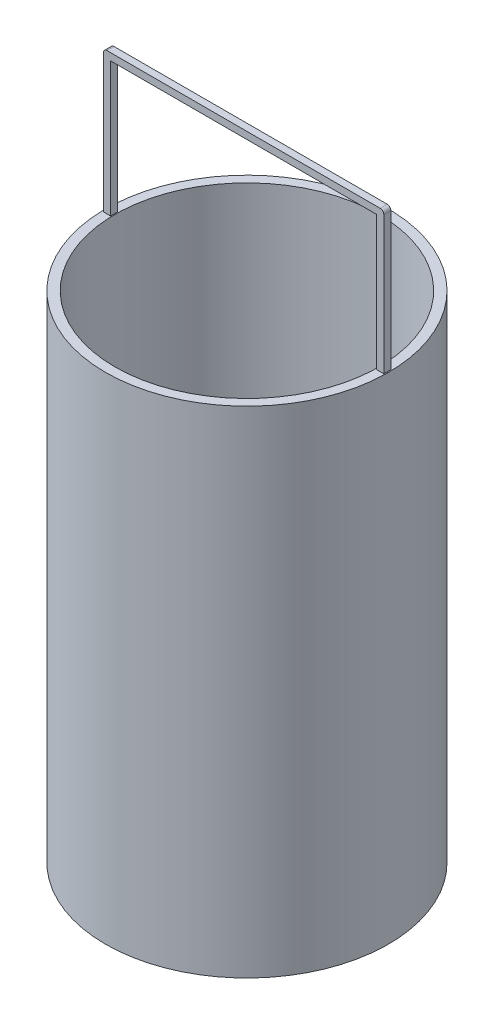
ISO-10303-21;
HEADER;
FILE_DESCRIPTION(('STEP AP214'),'2;1');
FILE_NAME('part.step','',(''),(''),'','','');
FILE_SCHEMA(('AUTOMOTIVE_DESIGN { 1 0 10303 214 1 1 1 1 }'));
ENDSEC;
DATA;
#1=APPLICATION_CONTEXT('core data for automotive mechanical design processes');
#2=APPLICATION_PROTOCOL_DEFINITION('international standard','automotive_design',2000,#1);
#3=PRODUCT_CONTEXT('',#1,'mechanical');
#4=PRODUCT('Part','Part','',(#3));
#5=PRODUCT_RELATED_PRODUCT_CATEGORY('part','',(#4));
#6=PRODUCT_DEFINITION_FORMATION('','',#4);
#7=PRODUCT_DEFINITION_CONTEXT('part definition',#1,'design');
#8=PRODUCT_DEFINITION('design','',#6,#7);
#9=PRODUCT_DEFINITION_SHAPE('','',#8);
#10=(LENGTH_UNIT() NAMED_UNIT(*) SI_UNIT(.MILLI.,.METRE.));
#11=(NAMED_UNIT(*) PLANE_ANGLE_UNIT() SI_UNIT($,.RADIAN.));
#12=(NAMED_UNIT(*) SI_UNIT($,.STERADIAN.) SOLID_ANGLE_UNIT());
#13=UNCERTAINTY_MEASURE_WITH_UNIT(LENGTH_MEASURE(1.E-05),#10,'distance_accuracy_value','');
#14=(GEOMETRIC_REPRESENTATION_CONTEXT(3) GLOBAL_UNCERTAINTY_ASSIGNED_CONTEXT((#13)) GLOBAL_UNIT_ASSIGNED_CONTEXT((#10,
#11,#12)) REPRESENTATION_CONTEXT('',''));
#15=CARTESIAN_POINT('',(0.,0.,0.));
#16=DIRECTION('',(0.,0.,1.));
#17=DIRECTION('',(1.,0.,0.));
#18=AXIS2_PLACEMENT_3D('',#15,#16,#17);
#19=CARTESIAN_POINT('',(0.,200.,0.));
#20=DIRECTION('',(0.,1.,0.));
#21=DIRECTION('',(0.,0.,1.));
#22=AXIS2_PLACEMENT_3D('',#19,#20,#21);
#23=PLANE('',#22);
#24=CARTESIAN_POINT('',(0.,200.,0.));
#25=DIRECTION('',(0.,1.,0.));
#26=DIRECTION('',(0.,0.,1.));
#27=AXIS2_PLACEMENT_3D('',#24,#25,#26);
#28=CIRCLE('',#27,112.);
#29=CARTESIAN_POINT('',(0.,200.,112.));
#30=VERTEX_POINT('',#29);
#31=EDGE_CURVE('E189',#30,#30,#28,.T.);
#32=ORIENTED_EDGE('',*,*,#31,.F.);
#33=EDGE_LOOP('',(#32));
#34=FACE_BOUND('',#33,.T.);
#35=CARTESIAN_POINT('',(0.,200.,0.));
#36=DIRECTION('',(0.,1.,0.));
#37=DIRECTION('',(0.,0.,1.));
#38=AXIS2_PLACEMENT_3D('',#35,#36,#37);
#39=CIRCLE('',#38,120.);
#40=CARTESIAN_POINT('',(0.,200.,120.));
#41=VERTEX_POINT('',#40);
#42=EDGE_CURVE('E202',#41,#41,#39,.T.);
#43=ORIENTED_EDGE('',*,*,#42,.T.);
#44=EDGE_LOOP('',(#43));
#45=FACE_BOUND('',#44,.T.);
#46=DIRECTION('',(0.,0.,1.));
#47=VECTOR('',#46,1.);
#48=CARTESIAN_POINT('',(113.045365563054,200.,-3.));
#49=LINE('',#48,#47);
#50=CARTESIAN_POINT('',(113.045365563054,200.,-3.));
#51=VERTEX_POINT('',#50);
#52=CARTESIAN_POINT('',(113.045365563054,200.,3.));
#53=VERTEX_POINT('',#52);
#54=EDGE_CURVE('E190',#51,#53,#49,.T.);
#55=ORIENTED_EDGE('',*,*,#54,.F.);
#56=DIRECTION('',(-1.,0.,0.));
#57=VECTOR('',#56,1.);
#58=CARTESIAN_POINT('',(0.,200.,-3.));
#59=LINE('',#58,#57);
#60=CARTESIAN_POINT('',(119.045365563054,200.,-3.));
#61=VERTEX_POINT('',#60);
#62=EDGE_CURVE('E179',#61,#51,#59,.T.);
#63=ORIENTED_EDGE('',*,*,#62,.F.);
#64=DIRECTION('',(0.,0.,1.));
#65=VECTOR('',#64,1.);
#66=CARTESIAN_POINT('',(119.045365563054,200.,-3.));
#67=LINE('',#66,#65);
#68=CARTESIAN_POINT('',(119.045365563054,200.,3.));
#69=VERTEX_POINT('',#68);
#70=EDGE_CURVE('E186',#61,#69,#67,.T.);
#71=ORIENTED_EDGE('',*,*,#70,.T.);
#72=DIRECTION('',(-1.,0.,0.));
#73=VECTOR('',#72,1.);
#74=CARTESIAN_POINT('',(0.,200.,3.));
#75=LINE('',#74,#73);
#76=EDGE_CURVE('E161',#69,#53,#75,.T.);
#77=ORIENTED_EDGE('',*,*,#76,.T.);
#78=EDGE_LOOP('',(#55,#63,#71,#77));
#79=FACE_BOUND('',#78,.T.);
#80=DIRECTION('',(0.,0.,1.));
#81=VECTOR('',#80,1.);
#82=CARTESIAN_POINT('',(-118.712281771735,200.,-3.));
#83=LINE('',#82,#81);
#84=CARTESIAN_POINT('',(-118.712281771735,200.,-3.));
#85=VERTEX_POINT('',#84);
#86=CARTESIAN_POINT('',(-118.712281771735,200.,3.));
#87=VERTEX_POINT('',#86);
#88=EDGE_CURVE('E140',#85,#87,#83,.T.);
#89=ORIENTED_EDGE('',*,*,#88,.F.);
#90=DIRECTION('',(1.,0.,0.));
#91=VECTOR('',#90,1.);
#92=CARTESIAN_POINT('',(0.,200.,-3.));
#93=LINE('',#92,#91);
#94=CARTESIAN_POINT('',(-112.712281771735,200.,-3.));
#95=VERTEX_POINT('',#94);
#96=EDGE_CURVE('E134',#85,#95,#93,.T.);
#97=ORIENTED_EDGE('',*,*,#96,.T.);
#98=DIRECTION('',(0.,0.,1.));
#99=VECTOR('',#98,1.);
#100=CARTESIAN_POINT('',(-112.712281771735,200.,-3.));
#101=LINE('',#100,#99);
#102=CARTESIAN_POINT('',(-112.712281771735,200.,3.));
#103=VERTEX_POINT('',#102);
#104=EDGE_CURVE('E129',#95,#103,#101,.T.);
#105=ORIENTED_EDGE('',*,*,#104,.T.);
#106=DIRECTION('',(1.,0.,0.));
#107=VECTOR('',#106,1.);
#108=CARTESIAN_POINT('',(0.,200.,3.));
#109=LINE('',#108,#107);
#110=EDGE_CURVE('E131',#87,#103,#109,.T.);
#111=ORIENTED_EDGE('',*,*,#110,.F.);
#112=EDGE_LOOP('',(#89,#97,#105,#111));
#113=FACE_BOUND('',#112,.T.);
#114=ADVANCED_FACE('F50',(#34,#45,#79,#113),#23,.T.);
#115=CARTESIAN_POINT('',(0.,-220.,0.));
#116=DIRECTION('',(0.,1.,0.));
#117=DIRECTION('',(0.,0.,1.));
#118=AXIS2_PLACEMENT_3D('',#115,#116,#117);
#119=CYLINDRICAL_SURFACE('',#118,120.);
#120=CARTESIAN_POINT('',(0.,-220.,0.));
#121=DIRECTION('',(0.,1.,0.));
#122=DIRECTION('',(0.,0.,1.));
#123=AXIS2_PLACEMENT_3D('',#120,#121,#122);
#124=CIRCLE('',#123,120.);
#125=CARTESIAN_POINT('',(0.,-220.,120.));
#126=VERTEX_POINT('',#125);
#127=EDGE_CURVE('E205',#126,#126,#124,.T.);
#128=ORIENTED_EDGE('',*,*,#127,.T.);
#129=EDGE_LOOP('',(#128));
#130=FACE_BOUND('',#129,.T.);
#131=ORIENTED_EDGE('',*,*,#42,.F.);
#132=EDGE_LOOP('',(#131));
#133=FACE_BOUND('',#132,.T.);
#134=ADVANCED_FACE('F249',(#130,#133),#119,.T.);
#135=CARTESIAN_POINT('',(0.,-220.,0.));
#136=DIRECTION('',(0.,1.,0.));
#137=DIRECTION('',(0.,0.,1.));
#138=AXIS2_PLACEMENT_3D('',#135,#136,#137);
#139=PLANE('',#138);
#140=CARTESIAN_POINT('',(0.,-220.,0.));
#141=DIRECTION('',(0.,1.,0.));
#142=DIRECTION('',(0.,0.,1.));
#143=AXIS2_PLACEMENT_3D('',#140,#141,#142);
#144=CIRCLE('',#143,112.);
#145=CARTESIAN_POINT('',(0.,-220.,112.));
#146=VERTEX_POINT('',#145);
#147=EDGE_CURVE('E199',#146,#146,#144,.F.);
#148=ORIENTED_EDGE('',*,*,#147,.F.);
#149=EDGE_LOOP('',(#148));
#150=FACE_BOUND('',#149,.T.);
#151=ORIENTED_EDGE('',*,*,#127,.F.);
#152=EDGE_LOOP('',(#151));
#153=FACE_BOUND('',#152,.T.);
#154=ADVANCED_FACE('F255',(#150,#153),#139,.F.);
#155=CARTESIAN_POINT('',(0.,-220.001,0.));
#156=DIRECTION('',(0.,1.,0.));
#157=DIRECTION('',(0.,0.,1.));
#158=AXIS2_PLACEMENT_3D('',#155,#156,#157);
#159=CYLINDRICAL_SURFACE('',#158,112.);
#160=ORIENTED_EDGE('',*,*,#31,.T.);
#161=EDGE_LOOP('',(#160));
#162=FACE_BOUND('',#161,.T.);
#163=ORIENTED_EDGE('',*,*,#147,.T.);
#164=EDGE_LOOP('',(#163));
#165=FACE_BOUND('',#164,.T.);
#166=ADVANCED_FACE('F262',(#162,#165),#159,.F.);
#167=CARTESIAN_POINT('',(-118.712281771735,0.,-3.));
#168=DIRECTION('',(1.,0.,0.));
#169=DIRECTION('',(0.,0.,-1.));
#170=AXIS2_PLACEMENT_3D('',#167,#168,#169);
#171=PLANE('',#170);
#172=DIRECTION('',(0.,1.,0.));
#173=VECTOR('',#172,1.);
#174=CARTESIAN_POINT('',(-118.712281771735,0.,3.));
#175=LINE('',#174,#173);
#176=CARTESIAN_POINT('',(-118.712281771735,317.,3.));
#177=VERTEX_POINT('',#176);
#178=EDGE_CURVE('E150',#87,#177,#175,.T.);
#179=ORIENTED_EDGE('',*,*,#178,.T.);
#180=DIRECTION('',(0.,0.,1.));
#181=VECTOR('',#180,1.);
#182=CARTESIAN_POINT('',(-118.712281771735,317.,-3.));
#183=LINE('',#182,#181);
#184=CARTESIAN_POINT('',(-118.712281771735,317.,-3.));
#185=VERTEX_POINT('',#184);
#186=EDGE_CURVE('E73',#177,#185,#183,.F.);
#187=ORIENTED_EDGE('',*,*,#186,.T.);
#188=DIRECTION('',(0.,1.,0.));
#189=VECTOR('',#188,1.);
#190=CARTESIAN_POINT('',(-118.712281771735,0.,-3.));
#191=LINE('',#190,#189);
#192=EDGE_CURVE('E168',#85,#185,#191,.T.);
#193=ORIENTED_EDGE('',*,*,#192,.F.);
#194=ORIENTED_EDGE('',*,*,#88,.T.);
#195=EDGE_LOOP('',(#179,#187,#193,#194));
#196=FACE_BOUND('',#195,.T.);
#197=ADVANCED_FACE('F227',(#196),#171,.F.);
#198=CARTESIAN_POINT('',(0.,320.,-3.));
#199=DIRECTION('',(0.,-1.,0.));
#200=DIRECTION('',(0.,0.,-1.));
#201=AXIS2_PLACEMENT_3D('',#198,#199,#200);
#202=PLANE('',#201);
#203=DIRECTION('',(1.,0.,0.));
#204=VECTOR('',#203,1.);
#205=CARTESIAN_POINT('',(0.,320.,-3.));
#206=LINE('',#205,#204);
#207=CARTESIAN_POINT('',(-115.712281771735,320.,-3.));
#208=VERTEX_POINT('',#207);
#209=CARTESIAN_POINT('',(116.045365563054,320.,-3.));
#210=VERTEX_POINT('',#209);
#211=EDGE_CURVE('E184',#208,#210,#206,.T.);
#212=ORIENTED_EDGE('',*,*,#211,.F.);
#213=DIRECTION('',(0.,0.,1.));
#214=VECTOR('',#213,1.);
#215=CARTESIAN_POINT('',(-115.712281771735,320.,-3.));
#216=LINE('',#215,#214);
#217=CARTESIAN_POINT('',(-115.712281771735,320.,3.));
#218=VERTEX_POINT('',#217);
#219=EDGE_CURVE('E210',#208,#218,#216,.T.);
#220=ORIENTED_EDGE('',*,*,#219,.T.);
#221=DIRECTION('',(1.,0.,0.));
#222=VECTOR('',#221,1.);
#223=CARTESIAN_POINT('',(0.,320.,3.));
#224=LINE('',#223,#222);
#225=CARTESIAN_POINT('',(116.045365563054,320.,3.));
#226=VERTEX_POINT('',#225);
#227=EDGE_CURVE('E165',#218,#226,#224,.T.);
#228=ORIENTED_EDGE('',*,*,#227,.T.);
#229=DIRECTION('',(0.,0.,1.));
#230=VECTOR('',#229,1.);
#231=CARTESIAN_POINT('',(116.045365563054,320.,-3.));
#232=LINE('',#231,#230);
#233=EDGE_CURVE('E208',#226,#210,#232,.F.);
#234=ORIENTED_EDGE('',*,*,#233,.T.);
#235=EDGE_LOOP('',(#212,#220,#228,#234));
#236=FACE_BOUND('',#235,.T.);
#237=ADVANCED_FACE('F224',(#236),#202,.F.);
#238=CARTESIAN_POINT('',(119.045365563054,0.,-3.));
#239=DIRECTION('',(-1.,0.,0.));
#240=DIRECTION('',(0.,-1.,0.));
#241=AXIS2_PLACEMENT_3D('',#238,#239,#240);
#242=PLANE('',#241);
#243=DIRECTION('',(0.,-1.,0.));
#244=VECTOR('',#243,1.);
#245=CARTESIAN_POINT('',(119.045365563054,0.,-3.));
#246=LINE('',#245,#244);
#247=CARTESIAN_POINT('',(119.045365563054,317.,-3.));
#248=VERTEX_POINT('',#247);
#249=EDGE_CURVE('E182',#248,#61,#246,.T.);
#250=ORIENTED_EDGE('',*,*,#249,.F.);
#251=DIRECTION('',(0.,0.,1.));
#252=VECTOR('',#251,1.);
#253=CARTESIAN_POINT('',(119.045365563054,317.,-3.));
#254=LINE('',#253,#252);
#255=CARTESIAN_POINT('',(119.045365563054,317.,3.));
#256=VERTEX_POINT('',#255);
#257=EDGE_CURVE('E13',#248,#256,#254,.T.);
#258=ORIENTED_EDGE('',*,*,#257,.T.);
#259=DIRECTION('',(0.,-1.,0.));
#260=VECTOR('',#259,1.);
#261=CARTESIAN_POINT('',(119.045365563054,0.,3.));
#262=LINE('',#261,#260);
#263=EDGE_CURVE('E163',#256,#69,#262,.T.);
#264=ORIENTED_EDGE('',*,*,#263,.T.);
#265=ORIENTED_EDGE('',*,*,#70,.F.);
#266=EDGE_LOOP('',(#250,#258,#264,#265));
#267=FACE_BOUND('',#266,.T.);
#268=ADVANCED_FACE('F241',(#267),#242,.F.);
#269=CARTESIAN_POINT('',(113.045365563054,0.,-3.));
#270=DIRECTION('',(-1.,0.,0.));
#271=DIRECTION('',(0.,-1.,0.));
#272=AXIS2_PLACEMENT_3D('',#269,#270,#271);
#273=PLANE('',#272);
#274=ORIENTED_EDGE('',*,*,#54,.T.);
#275=DIRECTION('',(0.,-1.,0.));
#276=VECTOR('',#275,1.);
#277=CARTESIAN_POINT('',(113.045365563054,0.,3.));
#278=LINE('',#277,#276);
#279=CARTESIAN_POINT('',(113.045365563054,314.,3.));
#280=VERTEX_POINT('',#279);
#281=EDGE_CURVE('E155',#280,#53,#278,.T.);
#282=ORIENTED_EDGE('',*,*,#281,.F.);
#283=DIRECTION('',(0.,0.,1.));
#284=VECTOR('',#283,1.);
#285=CARTESIAN_POINT('',(113.045365563054,314.,-3.));
#286=LINE('',#285,#284);
#287=CARTESIAN_POINT('',(113.045365563054,314.,-3.));
#288=VERTEX_POINT('',#287);
#289=EDGE_CURVE('E193',#288,#280,#286,.T.);
#290=ORIENTED_EDGE('',*,*,#289,.F.);
#291=DIRECTION('',(0.,-1.,0.));
#292=VECTOR('',#291,1.);
#293=CARTESIAN_POINT('',(113.045365563054,0.,-3.));
#294=LINE('',#293,#292);
#295=EDGE_CURVE('E176',#288,#51,#294,.T.);
#296=ORIENTED_EDGE('',*,*,#295,.T.);
#297=EDGE_LOOP('',(#274,#282,#290,#296));
#298=FACE_BOUND('',#297,.T.);
#299=ADVANCED_FACE('F235',(#298),#273,.T.);
#300=CARTESIAN_POINT('',(0.,314.,-3.));
#301=DIRECTION('',(0.,-1.,0.));
#302=DIRECTION('',(0.,0.,-1.));
#303=AXIS2_PLACEMENT_3D('',#300,#301,#302);
#304=PLANE('',#303);
#305=ORIENTED_EDGE('',*,*,#289,.T.);
#306=DIRECTION('',(1.,0.,0.));
#307=VECTOR('',#306,1.);
#308=CARTESIAN_POINT('',(0.,314.,3.));
#309=LINE('',#308,#307);
#310=CARTESIAN_POINT('',(-112.712281771735,314.,3.));
#311=VERTEX_POINT('',#310);
#312=EDGE_CURVE('E153',#311,#280,#309,.T.);
#313=ORIENTED_EDGE('',*,*,#312,.F.);
#314=DIRECTION('',(0.,0.,1.));
#315=VECTOR('',#314,1.);
#316=CARTESIAN_POINT('',(-112.712281771735,314.,-3.));
#317=LINE('',#316,#315);
#318=CARTESIAN_POINT('',(-112.712281771735,314.,-3.));
#319=VERTEX_POINT('',#318);
#320=EDGE_CURVE('E139',#319,#311,#317,.T.);
#321=ORIENTED_EDGE('',*,*,#320,.F.);
#322=DIRECTION('',(1.,0.,0.));
#323=VECTOR('',#322,1.);
#324=CARTESIAN_POINT('',(0.,314.,-3.));
#325=LINE('',#324,#323);
#326=EDGE_CURVE('E173',#319,#288,#325,.T.);
#327=ORIENTED_EDGE('',*,*,#326,.T.);
#328=EDGE_LOOP('',(#305,#313,#321,#327));
#329=FACE_BOUND('',#328,.T.);
#330=ADVANCED_FACE('F231',(#329),#304,.T.);
#331=CARTESIAN_POINT('',(-112.712281771735,0.,-3.));
#332=DIRECTION('',(1.,0.,0.));
#333=DIRECTION('',(0.,0.,-1.));
#334=AXIS2_PLACEMENT_3D('',#331,#332,#333);
#335=PLANE('',#334);
#336=ORIENTED_EDGE('',*,*,#320,.T.);
#337=DIRECTION('',(0.,1.,0.));
#338=VECTOR('',#337,1.);
#339=CARTESIAN_POINT('',(-112.712281771735,0.,3.));
#340=LINE('',#339,#338);
#341=EDGE_CURVE('E148',#103,#311,#340,.T.);
#342=ORIENTED_EDGE('',*,*,#341,.F.);
#343=ORIENTED_EDGE('',*,*,#104,.F.);
#344=DIRECTION('',(0.,1.,0.));
#345=VECTOR('',#344,1.);
#346=CARTESIAN_POINT('',(-112.712281771735,0.,-3.));
#347=LINE('',#346,#345);
#348=EDGE_CURVE('E171',#95,#319,#347,.T.);
#349=ORIENTED_EDGE('',*,*,#348,.T.);
#350=EDGE_LOOP('',(#336,#342,#343,#349));
#351=FACE_BOUND('',#350,.T.);
#352=ADVANCED_FACE('F152',(#351),#335,.T.);
#353=CARTESIAN_POINT('',(0.,0.,-3.));
#354=DIRECTION('',(0.,0.,1.));
#355=DIRECTION('',(1.,0.,0.));
#356=AXIS2_PLACEMENT_3D('',#353,#354,#355);
#357=PLANE('',#356);
#358=ORIENTED_EDGE('',*,*,#192,.T.);
#359=CARTESIAN_POINT('',(-115.712281771735,317.,-3.));
#360=DIRECTION('',(0.,0.,1.));
#361=DIRECTION('',(1.,0.,0.));
#362=AXIS2_PLACEMENT_3D('',#359,#360,#361);
#363=CIRCLE('',#362,3.);
#364=EDGE_CURVE('E58',#185,#208,#363,.F.);
#365=ORIENTED_EDGE('',*,*,#364,.T.);
#366=ORIENTED_EDGE('',*,*,#211,.T.);
#367=CARTESIAN_POINT('',(116.045365563054,317.,-3.));
#368=DIRECTION('',(0.,0.,1.));
#369=DIRECTION('',(1.,0.,0.));
#370=AXIS2_PLACEMENT_3D('',#367,#368,#369);
#371=CIRCLE('',#370,3.);
#372=EDGE_CURVE('E65',#210,#248,#371,.F.);
#373=ORIENTED_EDGE('',*,*,#372,.T.);
#374=ORIENTED_EDGE('',*,*,#249,.T.);
#375=ORIENTED_EDGE('',*,*,#62,.T.);
#376=ORIENTED_EDGE('',*,*,#295,.F.);
#377=ORIENTED_EDGE('',*,*,#326,.F.);
#378=ORIENTED_EDGE('',*,*,#348,.F.);
#379=ORIENTED_EDGE('',*,*,#96,.F.);
#380=EDGE_LOOP('',(#358,#365,#366,#373,#374,#375,#376,#377,#378,#379));
#381=FACE_BOUND('',#380,.T.);
#382=ADVANCED_FACE('F220',(#381),#357,.F.);
#383=CARTESIAN_POINT('',(0.,0.,3.));
#384=DIRECTION('',(0.,0.,1.));
#385=DIRECTION('',(1.,0.,0.));
#386=AXIS2_PLACEMENT_3D('',#383,#384,#385);
#387=PLANE('',#386);
#388=ORIENTED_EDGE('',*,*,#227,.F.);
#389=CARTESIAN_POINT('',(-115.712281771735,317.,3.));
#390=DIRECTION('',(0.,0.,1.));
#391=DIRECTION('',(1.,0.,0.));
#392=AXIS2_PLACEMENT_3D('',#389,#390,#391);
#393=CIRCLE('',#392,3.);
#394=EDGE_CURVE('E215',#218,#177,#393,.T.);
#395=ORIENTED_EDGE('',*,*,#394,.T.);
#396=ORIENTED_EDGE('',*,*,#178,.F.);
#397=ORIENTED_EDGE('',*,*,#110,.T.);
#398=ORIENTED_EDGE('',*,*,#341,.T.);
#399=ORIENTED_EDGE('',*,*,#312,.T.);
#400=ORIENTED_EDGE('',*,*,#281,.T.);
#401=ORIENTED_EDGE('',*,*,#76,.F.);
#402=ORIENTED_EDGE('',*,*,#263,.F.);
#403=CARTESIAN_POINT('',(116.045365563054,317.,3.));
#404=DIRECTION('',(0.,0.,1.));
#405=DIRECTION('',(1.,0.,0.));
#406=AXIS2_PLACEMENT_3D('',#403,#404,#405);
#407=CIRCLE('',#406,3.);
#408=EDGE_CURVE('E213',#256,#226,#407,.T.);
#409=ORIENTED_EDGE('',*,*,#408,.T.);
#410=EDGE_LOOP('',(#388,#395,#396,#397,#398,#399,#400,#401,#402,#409));
#411=FACE_BOUND('',#410,.T.);
#412=ADVANCED_FACE('F146',(#411),#387,.T.);
#413=CARTESIAN_POINT('',(-115.712281771735,317.,-3.));
#414=DIRECTION('',(0.,0.,1.));
#415=DIRECTION('',(1.,0.,0.));
#416=AXIS2_PLACEMENT_3D('',#413,#414,#415);
#417=CYLINDRICAL_SURFACE('',#416,3.);
#418=ORIENTED_EDGE('',*,*,#364,.F.);
#419=ORIENTED_EDGE('',*,*,#186,.F.);
#420=ORIENTED_EDGE('',*,*,#394,.F.);
#421=ORIENTED_EDGE('',*,*,#219,.F.);
#422=EDGE_LOOP('',(#418,#419,#420,#421));
#423=FACE_BOUND('',#422,.T.);
#424=ADVANCED_FACE('F226',(#423),#417,.T.);
#425=CARTESIAN_POINT('',(116.045365563054,317.,-3.));
#426=DIRECTION('',(0.,0.,1.));
#427=DIRECTION('',(1.,0.,0.));
#428=AXIS2_PLACEMENT_3D('',#425,#426,#427);
#429=CYLINDRICAL_SURFACE('',#428,3.);
#430=ORIENTED_EDGE('',*,*,#372,.F.);
#431=ORIENTED_EDGE('',*,*,#233,.F.);
#432=ORIENTED_EDGE('',*,*,#408,.F.);
#433=ORIENTED_EDGE('',*,*,#257,.F.);
#434=EDGE_LOOP('',(#430,#431,#432,#433));
#435=FACE_BOUND('',#434,.T.);
#436=ADVANCED_FACE('F52',(#435),#429,.T.);
#437=CLOSED_SHELL('',(#114,#134,#154,#166,#197,#237,#268,#299,#330,#352,#382,#412,#424,#436));
#438=MANIFOLD_SOLID_BREP('B2',#437);
#439=ADVANCED_BREP_SHAPE_REPRESENTATION('',(#18,#438),#14);
#440=SHAPE_DEFINITION_REPRESENTATION(#9,#439);
ENDSEC;
END-ISO-10303-21;
